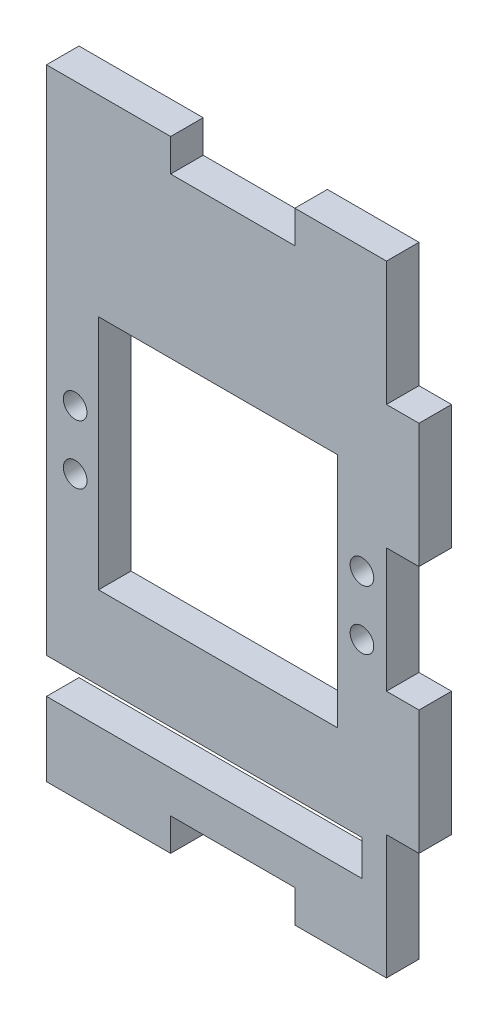
ISO-10303-21;
HEADER;
FILE_DESCRIPTION(('STEP AP214'),'2;1');
FILE_NAME('part.step','',(''),(''),'','','');
FILE_SCHEMA(('AUTOMOTIVE_DESIGN { 1 0 10303 214 1 1 1 1 }'));
ENDSEC;
DATA;
#1=APPLICATION_CONTEXT('core data for automotive mechanical design processes');
#2=APPLICATION_PROTOCOL_DEFINITION('international standard','automotive_design',2000,#1);
#3=PRODUCT_CONTEXT('',#1,'mechanical');
#4=PRODUCT('Part','Part','',(#3));
#5=PRODUCT_RELATED_PRODUCT_CATEGORY('part','',(#4));
#6=PRODUCT_DEFINITION_FORMATION('','',#4);
#7=PRODUCT_DEFINITION_CONTEXT('part definition',#1,'design');
#8=PRODUCT_DEFINITION('design','',#6,#7);
#9=PRODUCT_DEFINITION_SHAPE('','',#8);
#10=(LENGTH_UNIT() NAMED_UNIT(*) SI_UNIT(.MILLI.,.METRE.));
#11=(NAMED_UNIT(*) PLANE_ANGLE_UNIT() SI_UNIT($,.RADIAN.));
#12=(NAMED_UNIT(*) SI_UNIT($,.STERADIAN.) SOLID_ANGLE_UNIT());
#13=UNCERTAINTY_MEASURE_WITH_UNIT(LENGTH_MEASURE(1.E-05),#10,'distance_accuracy_value','');
#14=(GEOMETRIC_REPRESENTATION_CONTEXT(3) GLOBAL_UNCERTAINTY_ASSIGNED_CONTEXT((#13)) GLOBAL_UNIT_ASSIGNED_CONTEXT((#10,
#11,#12)) REPRESENTATION_CONTEXT('',''));
#15=CARTESIAN_POINT('',(0.,0.,0.));
#16=DIRECTION('',(0.,0.,1.));
#17=DIRECTION('',(1.,0.,0.));
#18=AXIS2_PLACEMENT_3D('',#15,#16,#17);
#19=CARTESIAN_POINT('',(0.,0.,5.5));
#20=DIRECTION('',(0.,0.,-1.));
#21=DIRECTION('',(-1.,0.,0.));
#22=AXIS2_PLACEMENT_3D('',#19,#20,#21);
#23=PLANE('',#22);
#24=DIRECTION('',(1.,0.,0.));
#25=VECTOR('',#24,1.);
#26=CARTESIAN_POINT('',(-10.5,-34.,5.5));
#27=LINE('',#26,#25);
#28=CARTESIAN_POINT('',(-10.5,-34.,5.5));
#29=VERTEX_POINT('',#28);
#30=CARTESIAN_POINT('',(42.85,-34.,5.5));
#31=VERTEX_POINT('',#30);
#32=EDGE_CURVE('E363',#29,#31,#27,.T.);
#33=ORIENTED_EDGE('',*,*,#32,.T.);
#34=DIRECTION('',(0.,-1.,0.));
#35=VECTOR('',#34,1.);
#36=CARTESIAN_POINT('',(42.85,-34.,5.5));
#37=LINE('',#36,#35);
#38=CARTESIAN_POINT('',(42.85,-40.,5.5));
#39=VERTEX_POINT('',#38);
#40=EDGE_CURVE('E366',#31,#39,#37,.T.);
#41=ORIENTED_EDGE('',*,*,#40,.T.);
#42=DIRECTION('',(-1.,0.,0.));
#43=VECTOR('',#42,1.);
#44=CARTESIAN_POINT('',(42.85,-40.,5.5));
#45=LINE('',#44,#43);
#46=CARTESIAN_POINT('',(-10.5,-40.,5.5));
#47=VERTEX_POINT('',#46);
#48=EDGE_CURVE('E369',#39,#47,#45,.T.);
#49=ORIENTED_EDGE('',*,*,#48,.T.);
#50=DIRECTION('',(0.,-1.,0.));
#51=VECTOR('',#50,1.);
#52=CARTESIAN_POINT('',(-10.5,-40.,5.5));
#53=LINE('',#52,#51);
#54=CARTESIAN_POINT('',(-10.5,-52.5,5.5));
#55=VERTEX_POINT('',#54);
#56=EDGE_CURVE('E371',#47,#55,#53,.T.);
#57=ORIENTED_EDGE('',*,*,#56,.T.);
#58=DIRECTION('',(-1.,0.,0.));
#59=VECTOR('',#58,1.);
#60=CARTESIAN_POINT('',(10.5,-52.5,5.5));
#61=LINE('',#60,#59);
#62=CARTESIAN_POINT('',(10.5,-52.5,5.5));
#63=VERTEX_POINT('',#62);
#64=EDGE_CURVE('E248',#63,#55,#61,.T.);
#65=ORIENTED_EDGE('',*,*,#64,.F.);
#66=DIRECTION('',(0.,1.,0.));
#67=VECTOR('',#66,1.);
#68=CARTESIAN_POINT('',(10.5,-50.,5.5));
#69=LINE('',#68,#67);
#70=CARTESIAN_POINT('',(10.5,-47.,5.5));
#71=VERTEX_POINT('',#70);
#72=EDGE_CURVE('E373',#63,#71,#69,.T.);
#73=ORIENTED_EDGE('',*,*,#72,.T.);
#74=DIRECTION('',(1.,0.,0.));
#75=VECTOR('',#74,1.);
#76=CARTESIAN_POINT('',(10.5,-47.,5.5));
#77=LINE('',#76,#75);
#78=CARTESIAN_POINT('',(31.5,-47.,5.5));
#79=VERTEX_POINT('',#78);
#80=EDGE_CURVE('E375',#71,#79,#77,.T.);
#81=ORIENTED_EDGE('',*,*,#80,.T.);
#82=DIRECTION('',(0.,-1.,0.));
#83=VECTOR('',#82,1.);
#84=CARTESIAN_POINT('',(31.5,-47.,5.5));
#85=LINE('',#84,#83);
#86=CARTESIAN_POINT('',(31.5,-52.5,5.5));
#87=VERTEX_POINT('',#86);
#88=EDGE_CURVE('E377',#79,#87,#85,.T.);
#89=ORIENTED_EDGE('',*,*,#88,.T.);
#90=DIRECTION('',(-1.,0.,0.));
#91=VECTOR('',#90,1.);
#92=CARTESIAN_POINT('',(47.,-52.5,5.5));
#93=LINE('',#92,#91);
#94=CARTESIAN_POINT('',(47.,-52.5,5.5));
#95=VERTEX_POINT('',#94);
#96=EDGE_CURVE('E262',#95,#87,#93,.T.);
#97=ORIENTED_EDGE('',*,*,#96,.F.);
#98=DIRECTION('',(0.,1.,0.));
#99=VECTOR('',#98,1.);
#100=CARTESIAN_POINT('',(47.,-50.,5.5));
#101=LINE('',#100,#99);
#102=CARTESIAN_POINT('',(47.,-31.5,5.5));
#103=VERTEX_POINT('',#102);
#104=EDGE_CURVE('E379',#95,#103,#101,.T.);
#105=ORIENTED_EDGE('',*,*,#104,.T.);
#106=DIRECTION('',(1.,0.,0.));
#107=VECTOR('',#106,1.);
#108=CARTESIAN_POINT('',(47.,-31.5,5.5));
#109=LINE('',#108,#107);
#110=CARTESIAN_POINT('',(52.5,-31.5,5.5));
#111=VERTEX_POINT('',#110);
#112=EDGE_CURVE('E381',#103,#111,#109,.T.);
#113=ORIENTED_EDGE('',*,*,#112,.T.);
#114=DIRECTION('',(0.,-1.,0.));
#115=VECTOR('',#114,1.);
#116=CARTESIAN_POINT('',(52.5,-10.5,5.5));
#117=LINE('',#116,#115);
#118=CARTESIAN_POINT('',(52.5,-10.5,5.5));
#119=VERTEX_POINT('',#118);
#120=EDGE_CURVE('E310',#119,#111,#117,.T.);
#121=ORIENTED_EDGE('',*,*,#120,.F.);
#122=DIRECTION('',(-1.,0.,0.));
#123=VECTOR('',#122,1.);
#124=CARTESIAN_POINT('',(50.,-10.5,5.5));
#125=LINE('',#124,#123);
#126=CARTESIAN_POINT('',(47.,-10.5,5.5));
#127=VERTEX_POINT('',#126);
#128=EDGE_CURVE('E383',#119,#127,#125,.T.);
#129=ORIENTED_EDGE('',*,*,#128,.T.);
#130=DIRECTION('',(0.,1.,0.));
#131=VECTOR('',#130,1.);
#132=CARTESIAN_POINT('',(47.,-10.5,5.5));
#133=LINE('',#132,#131);
#134=CARTESIAN_POINT('',(47.,10.5,5.5));
#135=VERTEX_POINT('',#134);
#136=EDGE_CURVE('E385',#127,#135,#133,.T.);
#137=ORIENTED_EDGE('',*,*,#136,.T.);
#138=DIRECTION('',(1.,0.,0.));
#139=VECTOR('',#138,1.);
#140=CARTESIAN_POINT('',(47.,10.5,5.5));
#141=LINE('',#140,#139);
#142=CARTESIAN_POINT('',(52.5,10.5,5.5));
#143=VERTEX_POINT('',#142);
#144=EDGE_CURVE('E387',#135,#143,#141,.T.);
#145=ORIENTED_EDGE('',*,*,#144,.T.);
#146=DIRECTION('',(0.,-1.,0.));
#147=VECTOR('',#146,1.);
#148=CARTESIAN_POINT('',(52.5,31.5,5.5));
#149=LINE('',#148,#147);
#150=CARTESIAN_POINT('',(52.5,31.5,5.5));
#151=VERTEX_POINT('',#150);
#152=EDGE_CURVE('E298',#151,#143,#149,.T.);
#153=ORIENTED_EDGE('',*,*,#152,.F.);
#154=DIRECTION('',(-1.,0.,0.));
#155=VECTOR('',#154,1.);
#156=CARTESIAN_POINT('',(50.,31.5,5.5));
#157=LINE('',#156,#155);
#158=CARTESIAN_POINT('',(47.,31.5,5.5));
#159=VERTEX_POINT('',#158);
#160=EDGE_CURVE('E389',#151,#159,#157,.T.);
#161=ORIENTED_EDGE('',*,*,#160,.T.);
#162=DIRECTION('',(0.,1.,0.));
#163=VECTOR('',#162,1.);
#164=CARTESIAN_POINT('',(47.,31.5,5.5));
#165=LINE('',#164,#163);
#166=CARTESIAN_POINT('',(47.,52.5,5.5));
#167=VERTEX_POINT('',#166);
#168=EDGE_CURVE('E391',#159,#167,#165,.T.);
#169=ORIENTED_EDGE('',*,*,#168,.T.);
#170=DIRECTION('',(1.,0.,0.));
#171=VECTOR('',#170,1.);
#172=CARTESIAN_POINT('',(31.5,52.5,5.5));
#173=LINE('',#172,#171);
#174=CARTESIAN_POINT('',(31.5,52.5,5.5));
#175=VERTEX_POINT('',#174);
#176=EDGE_CURVE('E286',#175,#167,#173,.T.);
#177=ORIENTED_EDGE('',*,*,#176,.F.);
#178=DIRECTION('',(0.,-1.,0.));
#179=VECTOR('',#178,1.);
#180=CARTESIAN_POINT('',(31.5,50.,5.5));
#181=LINE('',#180,#179);
#182=CARTESIAN_POINT('',(31.5,47.,5.5));
#183=VERTEX_POINT('',#182);
#184=EDGE_CURVE('E393',#175,#183,#181,.T.);
#185=ORIENTED_EDGE('',*,*,#184,.T.);
#186=DIRECTION('',(-1.,0.,0.));
#187=VECTOR('',#186,1.);
#188=CARTESIAN_POINT('',(31.5,47.,5.5));
#189=LINE('',#188,#187);
#190=CARTESIAN_POINT('',(10.5,47.,5.5));
#191=VERTEX_POINT('',#190);
#192=EDGE_CURVE('E395',#183,#191,#189,.T.);
#193=ORIENTED_EDGE('',*,*,#192,.T.);
#194=DIRECTION('',(0.,1.,0.));
#195=VECTOR('',#194,1.);
#196=CARTESIAN_POINT('',(10.5,47.,5.5));
#197=LINE('',#196,#195);
#198=CARTESIAN_POINT('',(10.5,52.5,5.5));
#199=VERTEX_POINT('',#198);
#200=EDGE_CURVE('E397',#191,#199,#197,.T.);
#201=ORIENTED_EDGE('',*,*,#200,.T.);
#202=DIRECTION('',(1.,0.,0.));
#203=VECTOR('',#202,1.);
#204=CARTESIAN_POINT('',(-10.5,52.5,5.5));
#205=LINE('',#204,#203);
#206=CARTESIAN_POINT('',(-10.5,52.5,5.5));
#207=VERTEX_POINT('',#206);
#208=EDGE_CURVE('E274',#207,#199,#205,.T.);
#209=ORIENTED_EDGE('',*,*,#208,.F.);
#210=DIRECTION('',(0.,-1.,0.));
#211=VECTOR('',#210,1.);
#212=CARTESIAN_POINT('',(-10.5,50.,5.5));
#213=LINE('',#212,#211);
#214=EDGE_CURVE('E399',#207,#29,#213,.T.);
#215=ORIENTED_EDGE('',*,*,#214,.T.);
#216=EDGE_LOOP('',(#33,#41,#49,#57,#65,#73,#81,#89,#97,#105,#113,#121,#129,#137,#145,#153,#161,
#169,#177,#185,#193,#201,#209,#215));
#217=FACE_BOUND('',#216,.T.);
#218=DIRECTION('',(0.,-1.,0.));
#219=VECTOR('',#218,1.);
#220=CARTESIAN_POINT('',(-1.70000000000001,20.,5.5));
#221=LINE('',#220,#219);
#222=CARTESIAN_POINT('',(-1.70000000000001,20.,5.5));
#223=VERTEX_POINT('',#222);
#224=CARTESIAN_POINT('',(-1.7,-20.,5.5));
#225=VERTEX_POINT('',#224);
#226=EDGE_CURVE('E337',#223,#225,#221,.T.);
#227=ORIENTED_EDGE('',*,*,#226,.F.);
#228=DIRECTION('',(-1.,0.,0.));
#229=VECTOR('',#228,1.);
#230=CARTESIAN_POINT('',(-1.70000000000001,20.,5.5));
#231=LINE('',#230,#229);
#232=CARTESIAN_POINT('',(38.7,20.,5.5));
#233=VERTEX_POINT('',#232);
#234=EDGE_CURVE('E344',#233,#223,#231,.T.);
#235=ORIENTED_EDGE('',*,*,#234,.F.);
#236=DIRECTION('',(0.,1.,0.));
#237=VECTOR('',#236,1.);
#238=CARTESIAN_POINT('',(38.7,20.,5.5));
#239=LINE('',#238,#237);
#240=CARTESIAN_POINT('',(38.7,-20.,5.5));
#241=VERTEX_POINT('',#240);
#242=EDGE_CURVE('E342',#241,#233,#239,.T.);
#243=ORIENTED_EDGE('',*,*,#242,.F.);
#244=DIRECTION('',(1.,0.,0.));
#245=VECTOR('',#244,1.);
#246=CARTESIAN_POINT('',(-1.7,-20.,5.5));
#247=LINE('',#246,#245);
#248=EDGE_CURVE('E339',#225,#241,#247,.T.);
#249=ORIENTED_EDGE('',*,*,#248,.F.);
#250=EDGE_LOOP('',(#227,#235,#243,#249));
#251=FACE_BOUND('',#250,.T.);
#252=CARTESIAN_POINT('',(42.85,5.00000000000001,5.5));
#253=DIRECTION('',(0.,0.,1.));
#254=DIRECTION('',(1.,0.,0.));
#255=AXIS2_PLACEMENT_3D('',#252,#253,#254);
#256=CIRCLE('',#255,2.);
#257=CARTESIAN_POINT('',(44.85,5.00000000000001,5.5));
#258=VERTEX_POINT('',#257);
#259=EDGE_CURVE('E332',#258,#258,#256,.T.);
#260=ORIENTED_EDGE('',*,*,#259,.F.);
#261=EDGE_LOOP('',(#260));
#262=FACE_BOUND('',#261,.T.);
#263=CARTESIAN_POINT('',(-5.65,5.00000000000001,5.5));
#264=DIRECTION('',(0.,0.,1.));
#265=DIRECTION('',(1.,0.,0.));
#266=AXIS2_PLACEMENT_3D('',#263,#264,#265);
#267=CIRCLE('',#266,2.);
#268=CARTESIAN_POINT('',(-3.65,5.00000000000001,5.5));
#269=VERTEX_POINT('',#268);
#270=EDGE_CURVE('E326',#269,#269,#267,.T.);
#271=ORIENTED_EDGE('',*,*,#270,.F.);
#272=EDGE_LOOP('',(#271));
#273=FACE_BOUND('',#272,.T.);
#274=CARTESIAN_POINT('',(42.85,-4.99999999999999,5.5));
#275=DIRECTION('',(0.,0.,1.));
#276=DIRECTION('',(-1.,0.,0.));
#277=AXIS2_PLACEMENT_3D('',#274,#275,#276);
#278=CIRCLE('',#277,2.);
#279=CARTESIAN_POINT('',(40.85,-4.99999999999999,5.5));
#280=VERTEX_POINT('',#279);
#281=EDGE_CURVE('E320',#280,#280,#278,.T.);
#282=ORIENTED_EDGE('',*,*,#281,.F.);
#283=EDGE_LOOP('',(#282));
#284=FACE_BOUND('',#283,.T.);
#285=CARTESIAN_POINT('',(-5.65,-4.99999999999999,5.5));
#286=DIRECTION('',(0.,0.,1.));
#287=DIRECTION('',(-1.,0.,0.));
#288=AXIS2_PLACEMENT_3D('',#285,#286,#287);
#289=CIRCLE('',#288,2.);
#290=CARTESIAN_POINT('',(-7.65,-4.99999999999999,5.5));
#291=VERTEX_POINT('',#290);
#292=EDGE_CURVE('E314',#291,#291,#289,.T.);
#293=ORIENTED_EDGE('',*,*,#292,.F.);
#294=EDGE_LOOP('',(#293));
#295=FACE_BOUND('',#294,.T.);
#296=ADVANCED_FACE('F33',(#217,#251,#262,#273,#284,#295),#23,.F.);
#297=CARTESIAN_POINT('',(0.,0.,0.));
#298=DIRECTION('',(0.,0.,-1.));
#299=DIRECTION('',(-1.,0.,0.));
#300=AXIS2_PLACEMENT_3D('',#297,#298,#299);
#301=PLANE('',#300);
#302=CARTESIAN_POINT('',(42.85,-4.99999999999999,0.));
#303=DIRECTION('',(0.,0.,1.));
#304=DIRECTION('',(-1.,0.,0.));
#305=AXIS2_PLACEMENT_3D('',#302,#303,#304);
#306=CIRCLE('',#305,2.);
#307=CARTESIAN_POINT('',(40.85,-4.99999999999999,0.));
#308=VERTEX_POINT('',#307);
#309=EDGE_CURVE('E317',#308,#308,#306,.T.);
#310=ORIENTED_EDGE('',*,*,#309,.T.);
#311=EDGE_LOOP('',(#310));
#312=FACE_BOUND('',#311,.T.);
#313=CARTESIAN_POINT('',(42.85,5.00000000000001,0.));
#314=DIRECTION('',(0.,0.,1.));
#315=DIRECTION('',(1.,0.,0.));
#316=AXIS2_PLACEMENT_3D('',#313,#314,#315);
#317=CIRCLE('',#316,2.);
#318=CARTESIAN_POINT('',(44.85,5.00000000000001,0.));
#319=VERTEX_POINT('',#318);
#320=EDGE_CURVE('E329',#319,#319,#317,.T.);
#321=ORIENTED_EDGE('',*,*,#320,.T.);
#322=EDGE_LOOP('',(#321));
#323=FACE_BOUND('',#322,.T.);
#324=DIRECTION('',(1.,0.,0.));
#325=VECTOR('',#324,1.);
#326=CARTESIAN_POINT('',(-10.5,-34.,0.));
#327=LINE('',#326,#325);
#328=CARTESIAN_POINT('',(-10.5,-34.,0.));
#329=VERTEX_POINT('',#328);
#330=CARTESIAN_POINT('',(42.85,-34.,0.));
#331=VERTEX_POINT('',#330);
#332=EDGE_CURVE('E362',#329,#331,#327,.T.);
#333=ORIENTED_EDGE('',*,*,#332,.F.);
#334=DIRECTION('',(0.,-1.,0.));
#335=VECTOR('',#334,1.);
#336=CARTESIAN_POINT('',(-10.5,50.,0.));
#337=LINE('',#336,#335);
#338=CARTESIAN_POINT('',(-10.5,52.5,0.));
#339=VERTEX_POINT('',#338);
#340=EDGE_CURVE('E367',#339,#329,#337,.T.);
#341=ORIENTED_EDGE('',*,*,#340,.F.);
#342=DIRECTION('',(-1.,0.,0.));
#343=VECTOR('',#342,1.);
#344=CARTESIAN_POINT('',(10.5,52.5,0.));
#345=LINE('',#344,#343);
#346=CARTESIAN_POINT('',(10.5,52.5,0.));
#347=VERTEX_POINT('',#346);
#348=EDGE_CURVE('E268',#347,#339,#345,.T.);
#349=ORIENTED_EDGE('',*,*,#348,.F.);
#350=DIRECTION('',(0.,1.,0.));
#351=VECTOR('',#350,1.);
#352=CARTESIAN_POINT('',(10.5,47.,0.));
#353=LINE('',#352,#351);
#354=CARTESIAN_POINT('',(10.5,47.,0.));
#355=VERTEX_POINT('',#354);
#356=EDGE_CURVE('E430',#355,#347,#353,.T.);
#357=ORIENTED_EDGE('',*,*,#356,.F.);
#358=DIRECTION('',(-1.,0.,0.));
#359=VECTOR('',#358,1.);
#360=CARTESIAN_POINT('',(31.5,47.,0.));
#361=LINE('',#360,#359);
#362=CARTESIAN_POINT('',(31.5,47.,0.));
#363=VERTEX_POINT('',#362);
#364=EDGE_CURVE('E428',#363,#355,#361,.T.);
#365=ORIENTED_EDGE('',*,*,#364,.F.);
#366=DIRECTION('',(0.,-1.,0.));
#367=VECTOR('',#366,1.);
#368=CARTESIAN_POINT('',(31.5,50.,0.));
#369=LINE('',#368,#367);
#370=CARTESIAN_POINT('',(31.5,52.5,0.));
#371=VERTEX_POINT('',#370);
#372=EDGE_CURVE('E426',#371,#363,#369,.T.);
#373=ORIENTED_EDGE('',*,*,#372,.F.);
#374=DIRECTION('',(-1.,0.,0.));
#375=VECTOR('',#374,1.);
#376=CARTESIAN_POINT('',(47.,52.5,0.));
#377=LINE('',#376,#375);
#378=CARTESIAN_POINT('',(47.,52.5,0.));
#379=VERTEX_POINT('',#378);
#380=EDGE_CURVE('E280',#379,#371,#377,.T.);
#381=ORIENTED_EDGE('',*,*,#380,.F.);
#382=DIRECTION('',(0.,1.,0.));
#383=VECTOR('',#382,1.);
#384=CARTESIAN_POINT('',(47.,31.5,0.));
#385=LINE('',#384,#383);
#386=CARTESIAN_POINT('',(47.,31.5,0.));
#387=VERTEX_POINT('',#386);
#388=EDGE_CURVE('E424',#387,#379,#385,.T.);
#389=ORIENTED_EDGE('',*,*,#388,.F.);
#390=DIRECTION('',(-1.,0.,0.));
#391=VECTOR('',#390,1.);
#392=CARTESIAN_POINT('',(50.,31.5,0.));
#393=LINE('',#392,#391);
#394=CARTESIAN_POINT('',(52.5,31.5,0.));
#395=VERTEX_POINT('',#394);
#396=EDGE_CURVE('E422',#395,#387,#393,.T.);
#397=ORIENTED_EDGE('',*,*,#396,.F.);
#398=DIRECTION('',(0.,1.,0.));
#399=VECTOR('',#398,1.);
#400=CARTESIAN_POINT('',(52.5,10.5,0.));
#401=LINE('',#400,#399);
#402=CARTESIAN_POINT('',(52.5,10.5,0.));
#403=VERTEX_POINT('',#402);
#404=EDGE_CURVE('E292',#403,#395,#401,.T.);
#405=ORIENTED_EDGE('',*,*,#404,.F.);
#406=DIRECTION('',(1.,0.,0.));
#407=VECTOR('',#406,1.);
#408=CARTESIAN_POINT('',(47.,10.5,0.));
#409=LINE('',#408,#407);
#410=CARTESIAN_POINT('',(47.,10.5,0.));
#411=VERTEX_POINT('',#410);
#412=EDGE_CURVE('E420',#411,#403,#409,.T.);
#413=ORIENTED_EDGE('',*,*,#412,.F.);
#414=DIRECTION('',(0.,1.,0.));
#415=VECTOR('',#414,1.);
#416=CARTESIAN_POINT('',(47.,-10.5,0.));
#417=LINE('',#416,#415);
#418=CARTESIAN_POINT('',(47.,-10.5,0.));
#419=VERTEX_POINT('',#418);
#420=EDGE_CURVE('E418',#419,#411,#417,.T.);
#421=ORIENTED_EDGE('',*,*,#420,.F.);
#422=DIRECTION('',(-1.,0.,0.));
#423=VECTOR('',#422,1.);
#424=CARTESIAN_POINT('',(50.,-10.5,0.));
#425=LINE('',#424,#423);
#426=CARTESIAN_POINT('',(52.5,-10.5,0.));
#427=VERTEX_POINT('',#426);
#428=EDGE_CURVE('E416',#427,#419,#425,.T.);
#429=ORIENTED_EDGE('',*,*,#428,.F.);
#430=DIRECTION('',(0.,1.,0.));
#431=VECTOR('',#430,1.);
#432=CARTESIAN_POINT('',(52.5,-31.5,0.));
#433=LINE('',#432,#431);
#434=CARTESIAN_POINT('',(52.5,-31.5,0.));
#435=VERTEX_POINT('',#434);
#436=EDGE_CURVE('E304',#435,#427,#433,.T.);
#437=ORIENTED_EDGE('',*,*,#436,.F.);
#438=DIRECTION('',(1.,0.,0.));
#439=VECTOR('',#438,1.);
#440=CARTESIAN_POINT('',(47.,-31.5,0.));
#441=LINE('',#440,#439);
#442=CARTESIAN_POINT('',(47.,-31.5,0.));
#443=VERTEX_POINT('',#442);
#444=EDGE_CURVE('E414',#443,#435,#441,.T.);
#445=ORIENTED_EDGE('',*,*,#444,.F.);
#446=DIRECTION('',(0.,1.,0.));
#447=VECTOR('',#446,1.);
#448=CARTESIAN_POINT('',(47.,-50.,0.));
#449=LINE('',#448,#447);
#450=CARTESIAN_POINT('',(47.,-52.5,0.));
#451=VERTEX_POINT('',#450);
#452=EDGE_CURVE('E412',#451,#443,#449,.T.);
#453=ORIENTED_EDGE('',*,*,#452,.F.);
#454=DIRECTION('',(1.,0.,0.));
#455=VECTOR('',#454,1.);
#456=CARTESIAN_POINT('',(31.5,-52.5,0.));
#457=LINE('',#456,#455);
#458=CARTESIAN_POINT('',(31.5,-52.5,0.));
#459=VERTEX_POINT('',#458);
#460=EDGE_CURVE('E256',#459,#451,#457,.T.);
#461=ORIENTED_EDGE('',*,*,#460,.F.);
#462=DIRECTION('',(0.,-1.,0.));
#463=VECTOR('',#462,1.);
#464=CARTESIAN_POINT('',(31.5,-47.,0.));
#465=LINE('',#464,#463);
#466=CARTESIAN_POINT('',(31.5,-47.,0.));
#467=VERTEX_POINT('',#466);
#468=EDGE_CURVE('E410',#467,#459,#465,.T.);
#469=ORIENTED_EDGE('',*,*,#468,.F.);
#470=DIRECTION('',(1.,0.,0.));
#471=VECTOR('',#470,1.);
#472=CARTESIAN_POINT('',(10.5,-47.,0.));
#473=LINE('',#472,#471);
#474=CARTESIAN_POINT('',(10.5,-47.,0.));
#475=VERTEX_POINT('',#474);
#476=EDGE_CURVE('E408',#475,#467,#473,.T.);
#477=ORIENTED_EDGE('',*,*,#476,.F.);
#478=DIRECTION('',(0.,1.,0.));
#479=VECTOR('',#478,1.);
#480=CARTESIAN_POINT('',(10.5,-50.,0.));
#481=LINE('',#480,#479);
#482=CARTESIAN_POINT('',(10.5,-52.5,0.));
#483=VERTEX_POINT('',#482);
#484=EDGE_CURVE('E231',#483,#475,#481,.T.);
#485=ORIENTED_EDGE('',*,*,#484,.F.);
#486=DIRECTION('',(1.,0.,0.));
#487=VECTOR('',#486,1.);
#488=CARTESIAN_POINT('',(-10.5,-52.5,0.));
#489=LINE('',#488,#487);
#490=CARTESIAN_POINT('',(-10.5,-52.5,0.));
#491=VERTEX_POINT('',#490);
#492=EDGE_CURVE('E235',#491,#483,#489,.T.);
#493=ORIENTED_EDGE('',*,*,#492,.F.);
#494=DIRECTION('',(0.,-1.,0.));
#495=VECTOR('',#494,1.);
#496=CARTESIAN_POINT('',(-10.5,-40.,0.));
#497=LINE('',#496,#495);
#498=CARTESIAN_POINT('',(-10.5,-40.,0.));
#499=VERTEX_POINT('',#498);
#500=EDGE_CURVE('E221',#499,#491,#497,.T.);
#501=ORIENTED_EDGE('',*,*,#500,.F.);
#502=DIRECTION('',(-1.,0.,0.));
#503=VECTOR('',#502,1.);
#504=CARTESIAN_POINT('',(42.85,-40.,0.));
#505=LINE('',#504,#503);
#506=CARTESIAN_POINT('',(42.85,-40.,0.));
#507=VERTEX_POINT('',#506);
#508=EDGE_CURVE('E232',#507,#499,#505,.T.);
#509=ORIENTED_EDGE('',*,*,#508,.F.);
#510=DIRECTION('',(0.,-1.,0.));
#511=VECTOR('',#510,1.);
#512=CARTESIAN_POINT('',(42.85,-34.,0.));
#513=LINE('',#512,#511);
#514=EDGE_CURVE('E404',#331,#507,#513,.T.);
#515=ORIENTED_EDGE('',*,*,#514,.F.);
#516=EDGE_LOOP('',(#333,#341,#349,#357,#365,#373,#381,#389,#397,#405,#413,#421,#429,#437,#445,
#453,#461,#469,#477,#485,#493,#501,#509,#515));
#517=FACE_BOUND('',#516,.T.);
#518=DIRECTION('',(-1.,0.,0.));
#519=VECTOR('',#518,1.);
#520=CARTESIAN_POINT('',(-1.70000000000001,20.,0.));
#521=LINE('',#520,#519);
#522=CARTESIAN_POINT('',(38.7,20.,0.));
#523=VERTEX_POINT('',#522);
#524=CARTESIAN_POINT('',(-1.70000000000001,20.,0.));
#525=VERTEX_POINT('',#524);
#526=EDGE_CURVE('E340',#523,#525,#521,.T.);
#527=ORIENTED_EDGE('',*,*,#526,.T.);
#528=DIRECTION('',(0.,-1.,0.));
#529=VECTOR('',#528,1.);
#530=CARTESIAN_POINT('',(-1.70000000000001,20.,0.));
#531=LINE('',#530,#529);
#532=CARTESIAN_POINT('',(-1.7,-20.,0.));
#533=VERTEX_POINT('',#532);
#534=EDGE_CURVE('E56',#525,#533,#531,.T.);
#535=ORIENTED_EDGE('',*,*,#534,.T.);
#536=DIRECTION('',(1.,0.,0.));
#537=VECTOR('',#536,1.);
#538=CARTESIAN_POINT('',(-1.7,-20.,0.));
#539=LINE('',#538,#537);
#540=CARTESIAN_POINT('',(38.7,-20.,0.));
#541=VERTEX_POINT('',#540);
#542=EDGE_CURVE('E348',#533,#541,#539,.T.);
#543=ORIENTED_EDGE('',*,*,#542,.T.);
#544=DIRECTION('',(0.,1.,0.));
#545=VECTOR('',#544,1.);
#546=CARTESIAN_POINT('',(38.7,20.,0.));
#547=LINE('',#546,#545);
#548=EDGE_CURVE('E351',#541,#523,#547,.T.);
#549=ORIENTED_EDGE('',*,*,#548,.T.);
#550=EDGE_LOOP('',(#527,#535,#543,#549));
#551=FACE_BOUND('',#550,.T.);
#552=CARTESIAN_POINT('',(-5.65,5.00000000000001,0.));
#553=DIRECTION('',(0.,0.,1.));
#554=DIRECTION('',(1.,0.,0.));
#555=AXIS2_PLACEMENT_3D('',#552,#553,#554);
#556=CIRCLE('',#555,2.);
#557=CARTESIAN_POINT('',(-3.65,5.00000000000001,0.));
#558=VERTEX_POINT('',#557);
#559=EDGE_CURVE('E323',#558,#558,#556,.T.);
#560=ORIENTED_EDGE('',*,*,#559,.T.);
#561=EDGE_LOOP('',(#560));
#562=FACE_BOUND('',#561,.T.);
#563=CARTESIAN_POINT('',(-5.65,-4.99999999999999,0.));
#564=DIRECTION('',(0.,0.,1.));
#565=DIRECTION('',(-1.,0.,0.));
#566=AXIS2_PLACEMENT_3D('',#563,#564,#565);
#567=CIRCLE('',#566,2.);
#568=CARTESIAN_POINT('',(-7.65,-4.99999999999999,0.));
#569=VERTEX_POINT('',#568);
#570=EDGE_CURVE('E313',#569,#569,#567,.T.);
#571=ORIENTED_EDGE('',*,*,#570,.T.);
#572=EDGE_LOOP('',(#571));
#573=FACE_BOUND('',#572,.T.);
#574=ADVANCED_FACE('F237',(#312,#323,#517,#551,#562,#573),#301,.T.);
#575=CARTESIAN_POINT('',(-10.5,-34.,5.5));
#576=DIRECTION('',(0.,1.,0.));
#577=DIRECTION('',(0.,0.,1.));
#578=AXIS2_PLACEMENT_3D('',#575,#576,#577);
#579=PLANE('',#578);
#580=ORIENTED_EDGE('',*,*,#332,.T.);
#581=DIRECTION('',(0.,0.,-1.));
#582=VECTOR('',#581,1.);
#583=CARTESIAN_POINT('',(42.85,-34.,5.5));
#584=LINE('',#583,#582);
#585=EDGE_CURVE('E11',#31,#331,#584,.T.);
#586=ORIENTED_EDGE('',*,*,#585,.F.);
#587=ORIENTED_EDGE('',*,*,#32,.F.);
#588=DIRECTION('',(0.,0.,-1.));
#589=VECTOR('',#588,1.);
#590=CARTESIAN_POINT('',(-10.5,-34.,5.5));
#591=LINE('',#590,#589);
#592=EDGE_CURVE('E401',#29,#329,#591,.T.);
#593=ORIENTED_EDGE('',*,*,#592,.T.);
#594=EDGE_LOOP('',(#580,#586,#587,#593));
#595=FACE_BOUND('',#594,.T.);
#596=ADVANCED_FACE('F35',(#595),#579,.F.);
#597=CARTESIAN_POINT('',(42.85,-34.,5.5));
#598=DIRECTION('',(1.,0.,0.));
#599=DIRECTION('',(0.,0.,-1.));
#600=AXIS2_PLACEMENT_3D('',#597,#598,#599);
#601=PLANE('',#600);
#602=ORIENTED_EDGE('',*,*,#514,.T.);
#603=DIRECTION('',(0.,0.,-1.));
#604=VECTOR('',#603,1.);
#605=CARTESIAN_POINT('',(42.85,-40.,5.5));
#606=LINE('',#605,#604);
#607=EDGE_CURVE('E41',#39,#507,#606,.T.);
#608=ORIENTED_EDGE('',*,*,#607,.F.);
#609=ORIENTED_EDGE('',*,*,#40,.F.);
#610=ORIENTED_EDGE('',*,*,#585,.T.);
#611=EDGE_LOOP('',(#602,#608,#609,#610));
#612=FACE_BOUND('',#611,.T.);
#613=ADVANCED_FACE('F466',(#612),#601,.F.);
#614=CARTESIAN_POINT('',(42.85,-40.,5.5));
#615=DIRECTION('',(0.,-1.,0.));
#616=DIRECTION('',(1.,0.,0.));
#617=AXIS2_PLACEMENT_3D('',#614,#615,#616);
#618=PLANE('',#617);
#619=ORIENTED_EDGE('',*,*,#508,.T.);
#620=DIRECTION('',(0.,0.,-1.));
#621=VECTOR('',#620,1.);
#622=CARTESIAN_POINT('',(-10.5,-40.,5.5));
#623=LINE('',#622,#621);
#624=EDGE_CURVE('E228',#47,#499,#623,.T.);
#625=ORIENTED_EDGE('',*,*,#624,.F.);
#626=ORIENTED_EDGE('',*,*,#48,.F.);
#627=ORIENTED_EDGE('',*,*,#607,.T.);
#628=EDGE_LOOP('',(#619,#625,#626,#627));
#629=FACE_BOUND('',#628,.T.);
#630=ADVANCED_FACE('F463',(#629),#618,.F.);
#631=CARTESIAN_POINT('',(-10.5,-40.,5.5));
#632=DIRECTION('',(1.,0.,0.));
#633=DIRECTION('',(0.,1.,0.));
#634=AXIS2_PLACEMENT_3D('',#631,#632,#633);
#635=PLANE('',#634);
#636=ORIENTED_EDGE('',*,*,#500,.T.);
#637=DIRECTION('',(0.,0.,-1.));
#638=VECTOR('',#637,1.);
#639=CARTESIAN_POINT('',(-10.5,-52.5,5.5));
#640=LINE('',#639,#638);
#641=EDGE_CURVE('E226',#55,#491,#640,.T.);
#642=ORIENTED_EDGE('',*,*,#641,.F.);
#643=ORIENTED_EDGE('',*,*,#56,.F.);
#644=ORIENTED_EDGE('',*,*,#624,.T.);
#645=EDGE_LOOP('',(#636,#642,#643,#644));
#646=FACE_BOUND('',#645,.T.);
#647=ADVANCED_FACE('F223',(#646),#635,.F.);
#648=CARTESIAN_POINT('',(10.5,-50.,5.5));
#649=DIRECTION('',(-1.,0.,0.));
#650=DIRECTION('',(0.,0.,1.));
#651=AXIS2_PLACEMENT_3D('',#648,#649,#650);
#652=PLANE('',#651);
#653=ORIENTED_EDGE('',*,*,#484,.T.);
#654=DIRECTION('',(0.,0.,-1.));
#655=VECTOR('',#654,1.);
#656=CARTESIAN_POINT('',(10.5,-47.,5.5));
#657=LINE('',#656,#655);
#658=EDGE_CURVE('E456',#71,#475,#657,.T.);
#659=ORIENTED_EDGE('',*,*,#658,.F.);
#660=ORIENTED_EDGE('',*,*,#72,.F.);
#661=DIRECTION('',(0.,0.,1.));
#662=VECTOR('',#661,1.);
#663=CARTESIAN_POINT('',(10.5,-52.5,0.));
#664=LINE('',#663,#662);
#665=EDGE_CURVE('E243',#483,#63,#664,.T.);
#666=ORIENTED_EDGE('',*,*,#665,.F.);
#667=EDGE_LOOP('',(#653,#659,#660,#666));
#668=FACE_BOUND('',#667,.T.);
#669=ADVANCED_FACE('F694',(#668),#652,.F.);
#670=CARTESIAN_POINT('',(10.5,-47.,5.5));
#671=DIRECTION('',(0.,1.,0.));
#672=DIRECTION('',(0.,0.,1.));
#673=AXIS2_PLACEMENT_3D('',#670,#671,#672);
#674=PLANE('',#673);
#675=ORIENTED_EDGE('',*,*,#476,.T.);
#676=DIRECTION('',(0.,0.,-1.));
#677=VECTOR('',#676,1.);
#678=CARTESIAN_POINT('',(31.5,-47.,5.5));
#679=LINE('',#678,#677);
#680=EDGE_CURVE('E453',#79,#467,#679,.T.);
#681=ORIENTED_EDGE('',*,*,#680,.F.);
#682=ORIENTED_EDGE('',*,*,#80,.F.);
#683=ORIENTED_EDGE('',*,*,#658,.T.);
#684=EDGE_LOOP('',(#675,#681,#682,#683));
#685=FACE_BOUND('',#684,.T.);
#686=ADVANCED_FACE('F686',(#685),#674,.F.);
#687=CARTESIAN_POINT('',(31.5,-47.,5.5));
#688=DIRECTION('',(1.,0.,0.));
#689=DIRECTION('',(0.,0.,-1.));
#690=AXIS2_PLACEMENT_3D('',#687,#688,#689);
#691=PLANE('',#690);
#692=ORIENTED_EDGE('',*,*,#468,.T.);
#693=DIRECTION('',(0.,0.,-1.));
#694=VECTOR('',#693,1.);
#695=CARTESIAN_POINT('',(31.5,-52.5,5.5));
#696=LINE('',#695,#694);
#697=EDGE_CURVE('E253',#87,#459,#696,.T.);
#698=ORIENTED_EDGE('',*,*,#697,.F.);
#699=ORIENTED_EDGE('',*,*,#88,.F.);
#700=ORIENTED_EDGE('',*,*,#680,.T.);
#701=EDGE_LOOP('',(#692,#698,#699,#700));
#702=FACE_BOUND('',#701,.T.);
#703=ADVANCED_FACE('F673',(#702),#691,.F.);
#704=CARTESIAN_POINT('',(47.,-50.,5.5));
#705=DIRECTION('',(-1.,0.,0.));
#706=DIRECTION('',(0.,0.,1.));
#707=AXIS2_PLACEMENT_3D('',#704,#705,#706);
#708=PLANE('',#707);
#709=ORIENTED_EDGE('',*,*,#452,.T.);
#710=DIRECTION('',(0.,0.,-1.));
#711=VECTOR('',#710,1.);
#712=CARTESIAN_POINT('',(47.,-31.5,5.5));
#713=LINE('',#712,#711);
#714=EDGE_CURVE('E450',#103,#443,#713,.T.);
#715=ORIENTED_EDGE('',*,*,#714,.F.);
#716=ORIENTED_EDGE('',*,*,#104,.F.);
#717=DIRECTION('',(0.,0.,1.));
#718=VECTOR('',#717,1.);
#719=CARTESIAN_POINT('',(47.,-52.5,0.));
#720=LINE('',#719,#718);
#721=EDGE_CURVE('E259',#451,#95,#720,.T.);
#722=ORIENTED_EDGE('',*,*,#721,.F.);
#723=EDGE_LOOP('',(#709,#715,#716,#722));
#724=FACE_BOUND('',#723,.T.);
#725=ADVANCED_FACE('F666',(#724),#708,.F.);
#726=CARTESIAN_POINT('',(47.,-31.5,5.5));
#727=DIRECTION('',(0.,1.,0.));
#728=DIRECTION('',(0.,0.,1.));
#729=AXIS2_PLACEMENT_3D('',#726,#727,#728);
#730=PLANE('',#729);
#731=ORIENTED_EDGE('',*,*,#444,.T.);
#732=DIRECTION('',(0.,0.,-1.));
#733=VECTOR('',#732,1.);
#734=CARTESIAN_POINT('',(52.5,-31.5,5.5));
#735=LINE('',#734,#733);
#736=EDGE_CURVE('E301',#111,#435,#735,.T.);
#737=ORIENTED_EDGE('',*,*,#736,.F.);
#738=ORIENTED_EDGE('',*,*,#112,.F.);
#739=ORIENTED_EDGE('',*,*,#714,.T.);
#740=EDGE_LOOP('',(#731,#737,#738,#739));
#741=FACE_BOUND('',#740,.T.);
#742=ADVANCED_FACE('F672',(#741),#730,.F.);
#743=CARTESIAN_POINT('',(50.,-10.5,5.5));
#744=DIRECTION('',(0.,-1.,0.));
#745=DIRECTION('',(0.,0.,-1.));
#746=AXIS2_PLACEMENT_3D('',#743,#744,#745);
#747=PLANE('',#746);
#748=ORIENTED_EDGE('',*,*,#428,.T.);
#749=DIRECTION('',(0.,0.,-1.));
#750=VECTOR('',#749,1.);
#751=CARTESIAN_POINT('',(47.,-10.5,5.5));
#752=LINE('',#751,#750);
#753=EDGE_CURVE('E447',#127,#419,#752,.T.);
#754=ORIENTED_EDGE('',*,*,#753,.F.);
#755=ORIENTED_EDGE('',*,*,#128,.F.);
#756=DIRECTION('',(0.,0.,1.));
#757=VECTOR('',#756,1.);
#758=CARTESIAN_POINT('',(52.5,-10.5,0.));
#759=LINE('',#758,#757);
#760=EDGE_CURVE('E307',#427,#119,#759,.T.);
#761=ORIENTED_EDGE('',*,*,#760,.F.);
#762=EDGE_LOOP('',(#748,#754,#755,#761));
#763=FACE_BOUND('',#762,.T.);
#764=ADVANCED_FACE('F782',(#763),#747,.F.);
#765=CARTESIAN_POINT('',(47.,-10.5,5.5));
#766=DIRECTION('',(-1.,0.,0.));
#767=DIRECTION('',(0.,-1.,0.));
#768=AXIS2_PLACEMENT_3D('',#765,#766,#767);
#769=PLANE('',#768);
#770=ORIENTED_EDGE('',*,*,#420,.T.);
#771=DIRECTION('',(0.,0.,-1.));
#772=VECTOR('',#771,1.);
#773=CARTESIAN_POINT('',(47.,10.5,5.5));
#774=LINE('',#773,#772);
#775=EDGE_CURVE('E444',#135,#411,#774,.T.);
#776=ORIENTED_EDGE('',*,*,#775,.F.);
#777=ORIENTED_EDGE('',*,*,#136,.F.);
#778=ORIENTED_EDGE('',*,*,#753,.T.);
#779=EDGE_LOOP('',(#770,#776,#777,#778));
#780=FACE_BOUND('',#779,.T.);
#781=ADVANCED_FACE('F520',(#780),#769,.F.);
#782=CARTESIAN_POINT('',(47.,10.5,5.5));
#783=DIRECTION('',(0.,1.,0.));
#784=DIRECTION('',(-1.,0.,0.));
#785=AXIS2_PLACEMENT_3D('',#782,#783,#784);
#786=PLANE('',#785);
#787=ORIENTED_EDGE('',*,*,#412,.T.);
#788=DIRECTION('',(0.,0.,-1.));
#789=VECTOR('',#788,1.);
#790=CARTESIAN_POINT('',(52.5,10.5,5.5));
#791=LINE('',#790,#789);
#792=EDGE_CURVE('E289',#143,#403,#791,.T.);
#793=ORIENTED_EDGE('',*,*,#792,.F.);
#794=ORIENTED_EDGE('',*,*,#144,.F.);
#795=ORIENTED_EDGE('',*,*,#775,.T.);
#796=EDGE_LOOP('',(#787,#793,#794,#795));
#797=FACE_BOUND('',#796,.T.);
#798=ADVANCED_FACE('F513',(#797),#786,.F.);
#799=CARTESIAN_POINT('',(50.,31.5,5.5));
#800=DIRECTION('',(0.,-1.,0.));
#801=DIRECTION('',(0.,0.,-1.));
#802=AXIS2_PLACEMENT_3D('',#799,#800,#801);
#803=PLANE('',#802);
#804=ORIENTED_EDGE('',*,*,#396,.T.);
#805=DIRECTION('',(0.,0.,-1.));
#806=VECTOR('',#805,1.);
#807=CARTESIAN_POINT('',(47.,31.5,5.5));
#808=LINE('',#807,#806);
#809=EDGE_CURVE('E441',#159,#387,#808,.T.);
#810=ORIENTED_EDGE('',*,*,#809,.F.);
#811=ORIENTED_EDGE('',*,*,#160,.F.);
#812=DIRECTION('',(0.,0.,1.));
#813=VECTOR('',#812,1.);
#814=CARTESIAN_POINT('',(52.5,31.5,0.));
#815=LINE('',#814,#813);
#816=EDGE_CURVE('E295',#395,#151,#815,.T.);
#817=ORIENTED_EDGE('',*,*,#816,.F.);
#818=EDGE_LOOP('',(#804,#810,#811,#817));
#819=FACE_BOUND('',#818,.T.);
#820=ADVANCED_FACE('F511',(#819),#803,.F.);
#821=CARTESIAN_POINT('',(47.,31.5,5.5));
#822=DIRECTION('',(-1.,0.,0.));
#823=DIRECTION('',(0.,0.,1.));
#824=AXIS2_PLACEMENT_3D('',#821,#822,#823);
#825=PLANE('',#824);
#826=ORIENTED_EDGE('',*,*,#388,.T.);
#827=DIRECTION('',(0.,0.,-1.));
#828=VECTOR('',#827,1.);
#829=CARTESIAN_POINT('',(47.,52.5,5.5));
#830=LINE('',#829,#828);
#831=EDGE_CURVE('E277',#167,#379,#830,.T.);
#832=ORIENTED_EDGE('',*,*,#831,.F.);
#833=ORIENTED_EDGE('',*,*,#168,.F.);
#834=ORIENTED_EDGE('',*,*,#809,.T.);
#835=EDGE_LOOP('',(#826,#832,#833,#834));
#836=FACE_BOUND('',#835,.T.);
#837=ADVANCED_FACE('F502',(#836),#825,.F.);
#838=CARTESIAN_POINT('',(31.5,50.,5.5));
#839=DIRECTION('',(1.,0.,0.));
#840=DIRECTION('',(0.,0.,-1.));
#841=AXIS2_PLACEMENT_3D('',#838,#839,#840);
#842=PLANE('',#841);
#843=ORIENTED_EDGE('',*,*,#372,.T.);
#844=DIRECTION('',(0.,0.,-1.));
#845=VECTOR('',#844,1.);
#846=CARTESIAN_POINT('',(31.5,47.,5.5));
#847=LINE('',#846,#845);
#848=EDGE_CURVE('E438',#183,#363,#847,.T.);
#849=ORIENTED_EDGE('',*,*,#848,.F.);
#850=ORIENTED_EDGE('',*,*,#184,.F.);
#851=DIRECTION('',(0.,0.,1.));
#852=VECTOR('',#851,1.);
#853=CARTESIAN_POINT('',(31.5,52.5,0.));
#854=LINE('',#853,#852);
#855=EDGE_CURVE('E283',#371,#175,#854,.T.);
#856=ORIENTED_EDGE('',*,*,#855,.F.);
#857=EDGE_LOOP('',(#843,#849,#850,#856));
#858=FACE_BOUND('',#857,.T.);
#859=ADVANCED_FACE('F490',(#858),#842,.F.);
#860=CARTESIAN_POINT('',(31.5,47.,5.5));
#861=DIRECTION('',(0.,-1.,0.));
#862=DIRECTION('',(0.,0.,-1.));
#863=AXIS2_PLACEMENT_3D('',#860,#861,#862);
#864=PLANE('',#863);
#865=ORIENTED_EDGE('',*,*,#364,.T.);
#866=DIRECTION('',(0.,0.,-1.));
#867=VECTOR('',#866,1.);
#868=CARTESIAN_POINT('',(10.5,47.,5.5));
#869=LINE('',#868,#867);
#870=EDGE_CURVE('E435',#191,#355,#869,.T.);
#871=ORIENTED_EDGE('',*,*,#870,.F.);
#872=ORIENTED_EDGE('',*,*,#192,.F.);
#873=ORIENTED_EDGE('',*,*,#848,.T.);
#874=EDGE_LOOP('',(#865,#871,#872,#873));
#875=FACE_BOUND('',#874,.T.);
#876=ADVANCED_FACE('F486',(#875),#864,.F.);
#877=CARTESIAN_POINT('',(10.5,47.,5.5));
#878=DIRECTION('',(-1.,0.,0.));
#879=DIRECTION('',(0.,0.,1.));
#880=AXIS2_PLACEMENT_3D('',#877,#878,#879);
#881=PLANE('',#880);
#882=ORIENTED_EDGE('',*,*,#356,.T.);
#883=DIRECTION('',(0.,0.,-1.));
#884=VECTOR('',#883,1.);
#885=CARTESIAN_POINT('',(10.5,52.5,5.5));
#886=LINE('',#885,#884);
#887=EDGE_CURVE('E265',#199,#347,#886,.T.);
#888=ORIENTED_EDGE('',*,*,#887,.F.);
#889=ORIENTED_EDGE('',*,*,#200,.F.);
#890=ORIENTED_EDGE('',*,*,#870,.T.);
#891=EDGE_LOOP('',(#882,#888,#889,#890));
#892=FACE_BOUND('',#891,.T.);
#893=ADVANCED_FACE('F481',(#892),#881,.F.);
#894=CARTESIAN_POINT('',(-10.5,50.,5.5));
#895=DIRECTION('',(1.,0.,0.));
#896=DIRECTION('',(0.,0.,-1.));
#897=AXIS2_PLACEMENT_3D('',#894,#895,#896);
#898=PLANE('',#897);
#899=ORIENTED_EDGE('',*,*,#340,.T.);
#900=ORIENTED_EDGE('',*,*,#592,.F.);
#901=ORIENTED_EDGE('',*,*,#214,.F.);
#902=DIRECTION('',(0.,0.,1.));
#903=VECTOR('',#902,1.);
#904=CARTESIAN_POINT('',(-10.5,52.5,0.));
#905=LINE('',#904,#903);
#906=EDGE_CURVE('E271',#339,#207,#905,.T.);
#907=ORIENTED_EDGE('',*,*,#906,.F.);
#908=EDGE_LOOP('',(#899,#900,#901,#907));
#909=FACE_BOUND('',#908,.T.);
#910=ADVANCED_FACE('F471',(#909),#898,.F.);
#911=CARTESIAN_POINT('',(-1.70000000000001,20.,5.5));
#912=DIRECTION('',(1.,0.,0.));
#913=DIRECTION('',(0.,1.,0.));
#914=AXIS2_PLACEMENT_3D('',#911,#912,#913);
#915=PLANE('',#914);
#916=ORIENTED_EDGE('',*,*,#534,.F.);
#917=DIRECTION('',(0.,0.,-1.));
#918=VECTOR('',#917,1.);
#919=CARTESIAN_POINT('',(-1.70000000000001,20.,5.5));
#920=LINE('',#919,#918);
#921=EDGE_CURVE('E346',#223,#525,#920,.T.);
#922=ORIENTED_EDGE('',*,*,#921,.F.);
#923=ORIENTED_EDGE('',*,*,#226,.T.);
#924=DIRECTION('',(0.,0.,-1.));
#925=VECTOR('',#924,1.);
#926=CARTESIAN_POINT('',(-1.7,-20.,5.5));
#927=LINE('',#926,#925);
#928=EDGE_CURVE('E360',#225,#533,#927,.T.);
#929=ORIENTED_EDGE('',*,*,#928,.T.);
#930=EDGE_LOOP('',(#916,#922,#923,#929));
#931=FACE_BOUND('',#930,.T.);
#932=ADVANCED_FACE('F531',(#931),#915,.T.);
#933=CARTESIAN_POINT('',(-1.7,-20.,5.5));
#934=DIRECTION('',(0.,1.,0.));
#935=DIRECTION('',(0.,0.,1.));
#936=AXIS2_PLACEMENT_3D('',#933,#934,#935);
#937=PLANE('',#936);
#938=ORIENTED_EDGE('',*,*,#542,.F.);
#939=ORIENTED_EDGE('',*,*,#928,.F.);
#940=ORIENTED_EDGE('',*,*,#248,.T.);
#941=DIRECTION('',(0.,0.,-1.));
#942=VECTOR('',#941,1.);
#943=CARTESIAN_POINT('',(38.7,-20.,5.5));
#944=LINE('',#943,#942);
#945=EDGE_CURVE('E358',#241,#541,#944,.T.);
#946=ORIENTED_EDGE('',*,*,#945,.T.);
#947=EDGE_LOOP('',(#938,#939,#940,#946));
#948=FACE_BOUND('',#947,.T.);
#949=ADVANCED_FACE('F565',(#948),#937,.T.);
#950=CARTESIAN_POINT('',(38.7,20.,5.5));
#951=DIRECTION('',(-1.,0.,0.));
#952=DIRECTION('',(0.,0.,1.));
#953=AXIS2_PLACEMENT_3D('',#950,#951,#952);
#954=PLANE('',#953);
#955=ORIENTED_EDGE('',*,*,#548,.F.);
#956=ORIENTED_EDGE('',*,*,#945,.F.);
#957=ORIENTED_EDGE('',*,*,#242,.T.);
#958=DIRECTION('',(0.,0.,-1.));
#959=VECTOR('',#958,1.);
#960=CARTESIAN_POINT('',(38.7,20.,5.5));
#961=LINE('',#960,#959);
#962=EDGE_CURVE('E48',#233,#523,#961,.T.);
#963=ORIENTED_EDGE('',*,*,#962,.T.);
#964=EDGE_LOOP('',(#955,#956,#957,#963));
#965=FACE_BOUND('',#964,.T.);
#966=ADVANCED_FACE('F571',(#965),#954,.T.);
#967=CARTESIAN_POINT('',(-1.70000000000001,20.,5.5));
#968=DIRECTION('',(0.,-1.,0.));
#969=DIRECTION('',(0.,0.,-1.));
#970=AXIS2_PLACEMENT_3D('',#967,#968,#969);
#971=PLANE('',#970);
#972=ORIENTED_EDGE('',*,*,#526,.F.);
#973=ORIENTED_EDGE('',*,*,#962,.F.);
#974=ORIENTED_EDGE('',*,*,#234,.T.);
#975=ORIENTED_EDGE('',*,*,#921,.T.);
#976=EDGE_LOOP('',(#972,#973,#974,#975));
#977=FACE_BOUND('',#976,.T.);
#978=ADVANCED_FACE('F578',(#977),#971,.T.);
#979=CARTESIAN_POINT('',(42.85,5.00000000000001,5.5));
#980=DIRECTION('',(0.,0.,-1.));
#981=DIRECTION('',(-1.,0.,0.));
#982=AXIS2_PLACEMENT_3D('',#979,#980,#981);
#983=CYLINDRICAL_SURFACE('',#982,2.);
#984=ORIENTED_EDGE('',*,*,#259,.T.);
#985=EDGE_LOOP('',(#984));
#986=FACE_BOUND('',#985,.T.);
#987=ORIENTED_EDGE('',*,*,#320,.F.);
#988=EDGE_LOOP('',(#987));
#989=FACE_BOUND('',#988,.T.);
#990=ADVANCED_FACE('F586',(#986,#989),#983,.F.);
#991=CARTESIAN_POINT('',(-5.65,5.00000000000001,5.5));
#992=DIRECTION('',(0.,0.,-1.));
#993=DIRECTION('',(-1.,0.,0.));
#994=AXIS2_PLACEMENT_3D('',#991,#992,#993);
#995=CYLINDRICAL_SURFACE('',#994,2.);
#996=ORIENTED_EDGE('',*,*,#270,.T.);
#997=EDGE_LOOP('',(#996));
#998=FACE_BOUND('',#997,.T.);
#999=ORIENTED_EDGE('',*,*,#559,.F.);
#1000=EDGE_LOOP('',(#999));
#1001=FACE_BOUND('',#1000,.T.);
#1002=ADVANCED_FACE('F593',(#998,#1001),#995,.F.);
#1003=CARTESIAN_POINT('',(42.85,-4.99999999999999,5.5));
#1004=DIRECTION('',(0.,0.,-1.));
#1005=DIRECTION('',(-1.,0.,0.));
#1006=AXIS2_PLACEMENT_3D('',#1003,#1004,#1005);
#1007=CYLINDRICAL_SURFACE('',#1006,2.);
#1008=ORIENTED_EDGE('',*,*,#281,.T.);
#1009=EDGE_LOOP('',(#1008));
#1010=FACE_BOUND('',#1009,.T.);
#1011=ORIENTED_EDGE('',*,*,#309,.F.);
#1012=EDGE_LOOP('',(#1011));
#1013=FACE_BOUND('',#1012,.T.);
#1014=ADVANCED_FACE('F601',(#1010,#1013),#1007,.F.);
#1015=CARTESIAN_POINT('',(-5.65,-4.99999999999999,5.5));
#1016=DIRECTION('',(0.,0.,-1.));
#1017=DIRECTION('',(-1.,0.,0.));
#1018=AXIS2_PLACEMENT_3D('',#1015,#1016,#1017);
#1019=CYLINDRICAL_SURFACE('',#1018,2.);
#1020=ORIENTED_EDGE('',*,*,#292,.T.);
#1021=EDGE_LOOP('',(#1020));
#1022=FACE_BOUND('',#1021,.T.);
#1023=ORIENTED_EDGE('',*,*,#570,.F.);
#1024=EDGE_LOOP('',(#1023));
#1025=FACE_BOUND('',#1024,.T.);
#1026=ADVANCED_FACE('F609',(#1022,#1025),#1019,.F.);
#1027=CARTESIAN_POINT('',(52.5,0.,0.));
#1028=DIRECTION('',(1.,0.,0.));
#1029=DIRECTION('',(0.,0.,-1.));
#1030=AXIS2_PLACEMENT_3D('',#1027,#1028,#1029);
#1031=PLANE('',#1030);
#1032=ORIENTED_EDGE('',*,*,#736,.T.);
#1033=ORIENTED_EDGE('',*,*,#436,.T.);
#1034=ORIENTED_EDGE('',*,*,#760,.T.);
#1035=ORIENTED_EDGE('',*,*,#120,.T.);
#1036=EDGE_LOOP('',(#1032,#1033,#1034,#1035));
#1037=FACE_BOUND('',#1036,.T.);
#1038=ADVANCED_FACE('F617',(#1037),#1031,.T.);
#1039=CARTESIAN_POINT('',(52.5,0.,0.));
#1040=DIRECTION('',(1.,0.,0.));
#1041=DIRECTION('',(0.,0.,-1.));
#1042=AXIS2_PLACEMENT_3D('',#1039,#1040,#1041);
#1043=PLANE('',#1042);
#1044=ORIENTED_EDGE('',*,*,#792,.T.);
#1045=ORIENTED_EDGE('',*,*,#404,.T.);
#1046=ORIENTED_EDGE('',*,*,#816,.T.);
#1047=ORIENTED_EDGE('',*,*,#152,.T.);
#1048=EDGE_LOOP('',(#1044,#1045,#1046,#1047));
#1049=FACE_BOUND('',#1048,.T.);
#1050=ADVANCED_FACE('F509',(#1049),#1043,.T.);
#1051=CARTESIAN_POINT('',(0.,52.5,0.));
#1052=DIRECTION('',(0.,1.,0.));
#1053=DIRECTION('',(0.,0.,1.));
#1054=AXIS2_PLACEMENT_3D('',#1051,#1052,#1053);
#1055=PLANE('',#1054);
#1056=ORIENTED_EDGE('',*,*,#831,.T.);
#1057=ORIENTED_EDGE('',*,*,#380,.T.);
#1058=ORIENTED_EDGE('',*,*,#855,.T.);
#1059=ORIENTED_EDGE('',*,*,#176,.T.);
#1060=EDGE_LOOP('',(#1056,#1057,#1058,#1059));
#1061=FACE_BOUND('',#1060,.T.);
#1062=ADVANCED_FACE('F494',(#1061),#1055,.T.);
#1063=CARTESIAN_POINT('',(0.,52.5,0.));
#1064=DIRECTION('',(0.,1.,0.));
#1065=DIRECTION('',(0.,0.,1.));
#1066=AXIS2_PLACEMENT_3D('',#1063,#1064,#1065);
#1067=PLANE('',#1066);
#1068=ORIENTED_EDGE('',*,*,#887,.T.);
#1069=ORIENTED_EDGE('',*,*,#348,.T.);
#1070=ORIENTED_EDGE('',*,*,#906,.T.);
#1071=ORIENTED_EDGE('',*,*,#208,.T.);
#1072=EDGE_LOOP('',(#1068,#1069,#1070,#1071));
#1073=FACE_BOUND('',#1072,.T.);
#1074=ADVANCED_FACE('F476',(#1073),#1067,.T.);
#1075=CARTESIAN_POINT('',(0.,-52.5,0.));
#1076=DIRECTION('',(0.,-1.,0.));
#1077=DIRECTION('',(0.,0.,-1.));
#1078=AXIS2_PLACEMENT_3D('',#1075,#1076,#1077);
#1079=PLANE('',#1078);
#1080=ORIENTED_EDGE('',*,*,#697,.T.);
#1081=ORIENTED_EDGE('',*,*,#460,.T.);
#1082=ORIENTED_EDGE('',*,*,#721,.T.);
#1083=ORIENTED_EDGE('',*,*,#96,.T.);
#1084=EDGE_LOOP('',(#1080,#1081,#1082,#1083));
#1085=FACE_BOUND('',#1084,.T.);
#1086=ADVANCED_FACE('F644',(#1085),#1079,.T.);
#1087=CARTESIAN_POINT('',(0.,-52.5,0.));
#1088=DIRECTION('',(0.,-1.,0.));
#1089=DIRECTION('',(0.,0.,-1.));
#1090=AXIS2_PLACEMENT_3D('',#1087,#1088,#1089);
#1091=PLANE('',#1090);
#1092=ORIENTED_EDGE('',*,*,#641,.T.);
#1093=ORIENTED_EDGE('',*,*,#492,.T.);
#1094=ORIENTED_EDGE('',*,*,#665,.T.);
#1095=ORIENTED_EDGE('',*,*,#64,.T.);
#1096=EDGE_LOOP('',(#1092,#1093,#1094,#1095));
#1097=FACE_BOUND('',#1096,.T.);
#1098=ADVANCED_FACE('F246',(#1097),#1091,.T.);
#1099=CLOSED_SHELL('',(#296,#574,#596,#613,#630,#647,#669,#686,#703,#725,#742,#764,#781,#798,
#820,#837,#859,#876,#893,#910,#932,#949,#966,#978,#990,#1002,#1014,#1026,#1038,#1050,#1062,
#1074,#1086,#1098));
#1100=MANIFOLD_SOLID_BREP('B2',#1099);
#1101=ADVANCED_BREP_SHAPE_REPRESENTATION('',(#18,#1100),#14);
#1102=SHAPE_DEFINITION_REPRESENTATION(#9,#1101);
ENDSEC;
END-ISO-10303-21;
